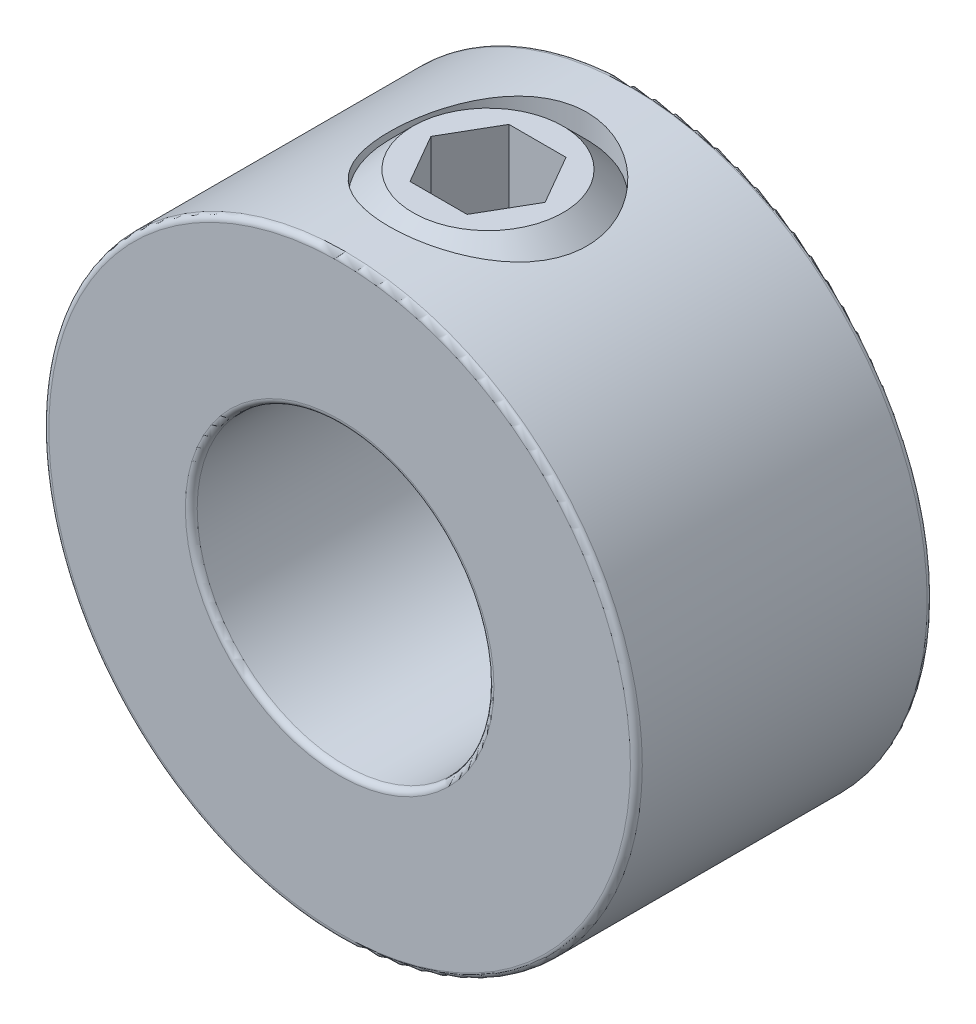
ISO-10303-21;
HEADER;
FILE_DESCRIPTION(('STEP AP214'),'2;1');
FILE_NAME('part.step','',(''),(''),'','','');
FILE_SCHEMA(('AUTOMOTIVE_DESIGN { 1 0 10303 214 1 1 1 1 }'));
ENDSEC;
DATA;
#1=APPLICATION_CONTEXT('core data for automotive mechanical design processes');
#2=APPLICATION_PROTOCOL_DEFINITION('international standard','automotive_design',2000,#1);
#3=PRODUCT_CONTEXT('',#1,'mechanical');
#4=PRODUCT('Part','Part','',(#3));
#5=PRODUCT_RELATED_PRODUCT_CATEGORY('part','',(#4));
#6=PRODUCT_DEFINITION_FORMATION('','',#4);
#7=PRODUCT_DEFINITION_CONTEXT('part definition',#1,'design');
#8=PRODUCT_DEFINITION('design','',#6,#7);
#9=PRODUCT_DEFINITION_SHAPE('','',#8);
#10=(LENGTH_UNIT() NAMED_UNIT(*) SI_UNIT(.MILLI.,.METRE.));
#11=(NAMED_UNIT(*) PLANE_ANGLE_UNIT() SI_UNIT($,.RADIAN.));
#12=(NAMED_UNIT(*) SI_UNIT($,.STERADIAN.) SOLID_ANGLE_UNIT());
#13=UNCERTAINTY_MEASURE_WITH_UNIT(LENGTH_MEASURE(1.E-05),#10,'distance_accuracy_value','');
#14=(GEOMETRIC_REPRESENTATION_CONTEXT(3) GLOBAL_UNCERTAINTY_ASSIGNED_CONTEXT((#13)) GLOBAL_UNIT_ASSIGNED_CONTEXT((#10,
#11,#12)) REPRESENTATION_CONTEXT('',''));
#15=CARTESIAN_POINT('',(0.,0.,0.));
#16=DIRECTION('',(0.,0.,1.));
#17=DIRECTION('',(1.,0.,0.));
#18=AXIS2_PLACEMENT_3D('',#15,#16,#17);
#19=CARTESIAN_POINT('',(0.,9.525,0.));
#20=DIRECTION('',(0.,1.,0.));
#21=DIRECTION('',(-1.,0.,0.));
#22=AXIS2_PLACEMENT_3D('',#19,#20,#21);
#23=PLANE('',#22);
#24=CARTESIAN_POINT('',(0.,9.525,0.));
#25=DIRECTION('',(0.,1.,0.));
#26=DIRECTION('',(-1.,0.,0.));
#27=AXIS2_PLACEMENT_3D('',#24,#25,#26);
#28=CIRCLE('',#27,2.40819263124403);
#29=CARTESIAN_POINT('',(-2.40819263124403,9.525,0.));
#30=VERTEX_POINT('',#29);
#31=EDGE_CURVE('E116',#30,#30,#28,.T.);
#32=ORIENTED_EDGE('',*,*,#31,.T.);
#33=EDGE_LOOP('',(#32));
#34=FACE_BOUND('',#33,.T.);
#35=DIRECTION('',(1.,0.,0.));
#36=VECTOR('',#35,1.);
#37=CARTESIAN_POINT('',(-0.916543552338531,9.525,-1.5875));
#38=LINE('',#37,#36);
#39=CARTESIAN_POINT('',(-0.916543552338531,9.525,-1.5875));
#40=VERTEX_POINT('',#39);
#41=CARTESIAN_POINT('',(0.916543552338531,9.525,-1.5875));
#42=VERTEX_POINT('',#41);
#43=EDGE_CURVE('E111',#40,#42,#38,.T.);
#44=ORIENTED_EDGE('',*,*,#43,.T.);
#45=DIRECTION('',(0.5,0.,0.866025403784438));
#46=VECTOR('',#45,1.);
#47=CARTESIAN_POINT('',(0.916543552338531,9.525,-1.5875));
#48=LINE('',#47,#46);
#49=CARTESIAN_POINT('',(1.83308710467706,9.525,0.));
#50=VERTEX_POINT('',#49);
#51=EDGE_CURVE('E57',#42,#50,#48,.T.);
#52=ORIENTED_EDGE('',*,*,#51,.T.);
#53=DIRECTION('',(-0.5,0.,0.866025403784439));
#54=VECTOR('',#53,1.);
#55=CARTESIAN_POINT('',(1.83308710467706,9.525,0.));
#56=LINE('',#55,#54);
#57=CARTESIAN_POINT('',(0.916543552338532,9.525,1.5875));
#58=VERTEX_POINT('',#57);
#59=EDGE_CURVE('E115',#50,#58,#56,.T.);
#60=ORIENTED_EDGE('',*,*,#59,.T.);
#61=DIRECTION('',(-1.,0.,0.));
#62=VECTOR('',#61,1.);
#63=CARTESIAN_POINT('',(0.916543552338532,9.525,1.5875));
#64=LINE('',#63,#62);
#65=CARTESIAN_POINT('',(-0.916543552338531,9.525,1.5875));
#66=VERTEX_POINT('',#65);
#67=EDGE_CURVE('E273',#58,#66,#64,.T.);
#68=ORIENTED_EDGE('',*,*,#67,.T.);
#69=DIRECTION('',(-0.5,0.,-0.866025403784439));
#70=VECTOR('',#69,1.);
#71=CARTESIAN_POINT('',(-0.916543552338531,9.525,1.5875));
#72=LINE('',#71,#70);
#73=CARTESIAN_POINT('',(-1.83308710467706,9.525,0.));
#74=VERTEX_POINT('',#73);
#75=EDGE_CURVE('E270',#66,#74,#72,.T.);
#76=ORIENTED_EDGE('',*,*,#75,.T.);
#77=DIRECTION('',(0.5,0.,-0.866025403784439));
#78=VECTOR('',#77,1.);
#79=CARTESIAN_POINT('',(-1.83308710467706,9.525,0.));
#80=LINE('',#79,#78);
#81=EDGE_CURVE('E264',#74,#40,#80,.T.);
#82=ORIENTED_EDGE('',*,*,#81,.T.);
#83=EDGE_LOOP('',(#44,#52,#60,#68,#76,#82));
#84=FACE_BOUND('',#83,.T.);
#85=ADVANCED_FACE('F42',(#34,#84),#23,.T.);
#86=CARTESIAN_POINT('',(0.,4.7625,0.));
#87=DIRECTION('',(0.,-1.,0.));
#88=DIRECTION('',(1.,0.,0.));
#89=AXIS2_PLACEMENT_3D('',#86,#87,#88);
#90=CONICAL_SURFACE('',#89,0.920168842507158,0.785398163397449);
#91=CARTESIAN_POINT('',(0.,5.68266884250716,0.));
#92=VERTEX_POINT('',#91);
#93=VERTEX_LOOP('',#92);
#94=FACE_BOUND('',#93,.T.);
#95=CARTESIAN_POINT('',(0.,4.7625,0.));
#96=DIRECTION('',(0.,1.,0.));
#97=DIRECTION('',(-1.,0.,0.));
#98=AXIS2_PLACEMENT_3D('',#95,#96,#97);
#99=CIRCLE('',#98,0.920168842507158);
#100=CARTESIAN_POINT('',(-0.920168842507158,4.7625,0.));
#101=VERTEX_POINT('',#100);
#102=EDGE_CURVE('E12',#101,#101,#99,.T.);
#103=ORIENTED_EDGE('',*,*,#102,.F.);
#104=EDGE_LOOP('',(#103));
#105=FACE_BOUND('',#104,.T.);
#106=ADVANCED_FACE('F44',(#94,#105),#90,.F.);
#107=CARTESIAN_POINT('',(-2.40819263124403,4.7625,0.));
#108=DIRECTION('',(0.,-1.,0.));
#109=DIRECTION('',(1.,0.,0.));
#110=AXIS2_PLACEMENT_3D('',#107,#108,#109);
#111=PLANE('',#110);
#112=ORIENTED_EDGE('',*,*,#102,.T.);
#113=EDGE_LOOP('',(#112));
#114=FACE_BOUND('',#113,.T.);
#115=CARTESIAN_POINT('',(0.,4.7625,0.));
#116=DIRECTION('',(0.,1.,0.));
#117=DIRECTION('',(-1.,0.,0.));
#118=AXIS2_PLACEMENT_3D('',#115,#116,#117);
#119=CIRCLE('',#118,2.40819263124403);
#120=CARTESIAN_POINT('',(-2.40819263124403,4.7625,0.));
#121=VERTEX_POINT('',#120);
#122=EDGE_CURVE('E50',#121,#121,#119,.T.);
#123=ORIENTED_EDGE('',*,*,#122,.F.);
#124=EDGE_LOOP('',(#123));
#125=FACE_BOUND('',#124,.T.);
#126=ADVANCED_FACE('F136',(#114,#125),#111,.T.);
#127=CARTESIAN_POINT('',(0.,5.52930736875596,0.));
#128=DIRECTION('',(0.,1.,0.));
#129=DIRECTION('',(-1.,0.,0.));
#130=AXIS2_PLACEMENT_3D('',#127,#128,#129);
#131=CONICAL_SURFACE('',#130,3.175,0.785398163397448);
#132=ORIENTED_EDGE('',*,*,#122,.T.);
#133=EDGE_LOOP('',(#132));
#134=FACE_BOUND('',#133,.T.);
#135=CARTESIAN_POINT('',(0.,5.52930736875596,0.));
#136=DIRECTION('',(0.,1.,0.));
#137=DIRECTION('',(-1.,0.,0.));
#138=AXIS2_PLACEMENT_3D('',#135,#136,#137);
#139=CIRCLE('',#138,3.175);
#140=CARTESIAN_POINT('',(-3.175,5.52930736875596,0.));
#141=VERTEX_POINT('',#140);
#142=EDGE_CURVE('E128',#141,#141,#139,.T.);
#143=ORIENTED_EDGE('',*,*,#142,.F.);
#144=EDGE_LOOP('',(#143));
#145=FACE_BOUND('',#144,.T.);
#146=ADVANCED_FACE('F133',(#134,#145),#131,.T.);
#147=CARTESIAN_POINT('',(0.,4.7625,0.));
#148=DIRECTION('',(0.,1.,0.));
#149=DIRECTION('',(-1.,0.,0.));
#150=AXIS2_PLACEMENT_3D('',#147,#148,#149);
#151=CYLINDRICAL_SURFACE('',#150,3.175);
#152=ORIENTED_EDGE('',*,*,#142,.T.);
#153=EDGE_LOOP('',(#152));
#154=FACE_BOUND('',#153,.T.);
#155=CARTESIAN_POINT('',(0.,8.75819263124404,0.));
#156=DIRECTION('',(0.,1.,0.));
#157=DIRECTION('',(-1.,0.,0.));
#158=AXIS2_PLACEMENT_3D('',#155,#156,#157);
#159=CIRCLE('',#158,3.175);
#160=CARTESIAN_POINT('',(-3.175,8.75819263124404,0.));
#161=VERTEX_POINT('',#160);
#162=EDGE_CURVE('E120',#161,#161,#159,.T.);
#163=ORIENTED_EDGE('',*,*,#162,.F.);
#164=EDGE_LOOP('',(#163));
#165=FACE_BOUND('',#164,.T.);
#166=ADVANCED_FACE('F143',(#154,#165),#151,.T.);
#167=CARTESIAN_POINT('',(0.,9.525,0.));
#168=DIRECTION('',(0.,-1.,0.));
#169=DIRECTION('',(1.,0.,0.));
#170=AXIS2_PLACEMENT_3D('',#167,#168,#169);
#171=CONICAL_SURFACE('',#170,2.40819263124403,0.785398163397448);
#172=ORIENTED_EDGE('',*,*,#162,.T.);
#173=EDGE_LOOP('',(#172));
#174=FACE_BOUND('',#173,.T.);
#175=ORIENTED_EDGE('',*,*,#31,.F.);
#176=EDGE_LOOP('',(#175));
#177=FACE_BOUND('',#176,.T.);
#178=ADVANCED_FACE('F154',(#174,#177),#171,.T.);
#179=CARTESIAN_POINT('',(0.916543552338531,6.35,-1.5875));
#180=DIRECTION('',(-0.866025403784438,0.,0.5));
#181=DIRECTION('',(0.5,0.,0.866025403784439));
#182=AXIS2_PLACEMENT_3D('',#179,#180,#181);
#183=PLANE('',#182);
#184=ORIENTED_EDGE('',*,*,#51,.F.);
#185=DIRECTION('',(0.,1.,0.));
#186=VECTOR('',#185,1.);
#187=CARTESIAN_POINT('',(0.916543552338531,6.35,-1.5875));
#188=LINE('',#187,#186);
#189=CARTESIAN_POINT('',(0.916543552338531,6.35,-1.5875));
#190=VERTEX_POINT('',#189);
#191=EDGE_CURVE('E110',#190,#42,#188,.T.);
#192=ORIENTED_EDGE('',*,*,#191,.F.);
#193=DIRECTION('',(0.5,0.,0.866025403784438));
#194=VECTOR('',#193,1.);
#195=CARTESIAN_POINT('',(0.916543552338531,6.35,-1.5875));
#196=LINE('',#195,#194);
#197=CARTESIAN_POINT('',(1.83308710467706,6.35,0.));
#198=VERTEX_POINT('',#197);
#199=EDGE_CURVE('E101',#190,#198,#196,.T.);
#200=ORIENTED_EDGE('',*,*,#199,.T.);
#201=DIRECTION('',(0.,1.,0.));
#202=VECTOR('',#201,1.);
#203=CARTESIAN_POINT('',(1.83308710467706,6.35,0.));
#204=LINE('',#203,#202);
#205=EDGE_CURVE('E109',#198,#50,#204,.T.);
#206=ORIENTED_EDGE('',*,*,#205,.T.);
#207=EDGE_LOOP('',(#184,#192,#200,#206));
#208=FACE_BOUND('',#207,.T.);
#209=ADVANCED_FACE('F108',(#208),#183,.T.);
#210=CARTESIAN_POINT('',(1.83308710467706,6.35,0.));
#211=DIRECTION('',(-0.866025403784439,0.,-0.5));
#212=DIRECTION('',(-0.5,0.,0.866025403784439));
#213=AXIS2_PLACEMENT_3D('',#210,#211,#212);
#214=PLANE('',#213);
#215=ORIENTED_EDGE('',*,*,#59,.F.);
#216=ORIENTED_EDGE('',*,*,#205,.F.);
#217=DIRECTION('',(-0.5,0.,0.866025403784439));
#218=VECTOR('',#217,1.);
#219=CARTESIAN_POINT('',(1.83308710467706,6.35,0.));
#220=LINE('',#219,#218);
#221=CARTESIAN_POINT('',(0.916543552338532,6.35,1.5875));
#222=VERTEX_POINT('',#221);
#223=EDGE_CURVE('E97',#198,#222,#220,.T.);
#224=ORIENTED_EDGE('',*,*,#223,.T.);
#225=DIRECTION('',(0.,1.,0.));
#226=VECTOR('',#225,1.);
#227=CARTESIAN_POINT('',(0.916543552338532,6.35,1.5875));
#228=LINE('',#227,#226);
#229=EDGE_CURVE('E117',#222,#58,#228,.T.);
#230=ORIENTED_EDGE('',*,*,#229,.T.);
#231=EDGE_LOOP('',(#215,#216,#224,#230));
#232=FACE_BOUND('',#231,.T.);
#233=ADVANCED_FACE('F113',(#232),#214,.T.);
#234=CARTESIAN_POINT('',(0.916543552338532,6.35,1.5875));
#235=DIRECTION('',(0.,0.,-1.));
#236=DIRECTION('',(-1.,0.,0.));
#237=AXIS2_PLACEMENT_3D('',#234,#235,#236);
#238=PLANE('',#237);
#239=ORIENTED_EDGE('',*,*,#67,.F.);
#240=ORIENTED_EDGE('',*,*,#229,.F.);
#241=DIRECTION('',(-1.,0.,0.));
#242=VECTOR('',#241,1.);
#243=CARTESIAN_POINT('',(0.916543552338532,6.35,1.5875));
#244=LINE('',#243,#242);
#245=CARTESIAN_POINT('',(-0.916543552338531,6.35,1.5875));
#246=VERTEX_POINT('',#245);
#247=EDGE_CURVE('E103',#222,#246,#244,.T.);
#248=ORIENTED_EDGE('',*,*,#247,.T.);
#249=DIRECTION('',(0.,1.,0.));
#250=VECTOR('',#249,1.);
#251=CARTESIAN_POINT('',(-0.916543552338531,6.35,1.5875));
#252=LINE('',#251,#250);
#253=EDGE_CURVE('E122',#246,#66,#252,.T.);
#254=ORIENTED_EDGE('',*,*,#253,.T.);
#255=EDGE_LOOP('',(#239,#240,#248,#254));
#256=FACE_BOUND('',#255,.T.);
#257=ADVANCED_FACE('F184',(#256),#238,.T.);
#258=CARTESIAN_POINT('',(-0.916543552338531,6.35,1.5875));
#259=DIRECTION('',(0.866025403784439,0.,-0.5));
#260=DIRECTION('',(-0.5,0.,-0.866025403784439));
#261=AXIS2_PLACEMENT_3D('',#258,#259,#260);
#262=PLANE('',#261);
#263=ORIENTED_EDGE('',*,*,#75,.F.);
#264=ORIENTED_EDGE('',*,*,#253,.F.);
#265=DIRECTION('',(-0.5,0.,-0.866025403784439));
#266=VECTOR('',#265,1.);
#267=CARTESIAN_POINT('',(-0.916543552338531,6.35,1.5875));
#268=LINE('',#267,#266);
#269=CARTESIAN_POINT('',(-1.83308710467706,6.35,0.));
#270=VERTEX_POINT('',#269);
#271=EDGE_CURVE('E289',#246,#270,#268,.T.);
#272=ORIENTED_EDGE('',*,*,#271,.T.);
#273=DIRECTION('',(0.,1.,0.));
#274=VECTOR('',#273,1.);
#275=CARTESIAN_POINT('',(-1.83308710467706,6.35,0.));
#276=LINE('',#275,#274);
#277=EDGE_CURVE('E280',#270,#74,#276,.T.);
#278=ORIENTED_EDGE('',*,*,#277,.T.);
#279=EDGE_LOOP('',(#263,#264,#272,#278));
#280=FACE_BOUND('',#279,.T.);
#281=ADVANCED_FACE('F190',(#280),#262,.T.);
#282=CARTESIAN_POINT('',(-1.83308710467706,6.35,0.));
#283=DIRECTION('',(0.866025403784439,0.,0.5));
#284=DIRECTION('',(0.5,0.,-0.866025403784439));
#285=AXIS2_PLACEMENT_3D('',#282,#283,#284);
#286=PLANE('',#285);
#287=ORIENTED_EDGE('',*,*,#81,.F.);
#288=ORIENTED_EDGE('',*,*,#277,.F.);
#289=DIRECTION('',(0.5,0.,-0.866025403784439));
#290=VECTOR('',#289,1.);
#291=CARTESIAN_POINT('',(-1.83308710467706,6.35,0.));
#292=LINE('',#291,#290);
#293=CARTESIAN_POINT('',(-0.916543552338531,6.35,-1.5875));
#294=VERTEX_POINT('',#293);
#295=EDGE_CURVE('E287',#270,#294,#292,.T.);
#296=ORIENTED_EDGE('',*,*,#295,.T.);
#297=DIRECTION('',(0.,1.,0.));
#298=VECTOR('',#297,1.);
#299=CARTESIAN_POINT('',(-0.916543552338531,6.35,-1.5875));
#300=LINE('',#299,#298);
#301=EDGE_CURVE('E263',#294,#40,#300,.T.);
#302=ORIENTED_EDGE('',*,*,#301,.T.);
#303=EDGE_LOOP('',(#287,#288,#296,#302));
#304=FACE_BOUND('',#303,.T.);
#305=ADVANCED_FACE('F198',(#304),#286,.T.);
#306=CARTESIAN_POINT('',(-0.916543552338531,6.35,-1.5875));
#307=DIRECTION('',(0.,0.,1.));
#308=DIRECTION('',(1.,0.,0.));
#309=AXIS2_PLACEMENT_3D('',#306,#307,#308);
#310=PLANE('',#309);
#311=ORIENTED_EDGE('',*,*,#43,.F.);
#312=ORIENTED_EDGE('',*,*,#301,.F.);
#313=DIRECTION('',(1.,0.,0.));
#314=VECTOR('',#313,1.);
#315=CARTESIAN_POINT('',(-0.916543552338531,6.35,-1.5875));
#316=LINE('',#315,#314);
#317=EDGE_CURVE('E278',#294,#190,#316,.T.);
#318=ORIENTED_EDGE('',*,*,#317,.T.);
#319=ORIENTED_EDGE('',*,*,#191,.T.);
#320=EDGE_LOOP('',(#311,#312,#318,#319));
#321=FACE_BOUND('',#320,.T.);
#322=ADVANCED_FACE('F206',(#321),#310,.T.);
#323=CARTESIAN_POINT('',(0.,6.35,-3.175));
#324=DIRECTION('',(0.,1.,0.));
#325=DIRECTION('',(0.,0.,1.));
#326=AXIS2_PLACEMENT_3D('',#323,#324,#325);
#327=PLANE('',#326);
#328=ORIENTED_EDGE('',*,*,#199,.F.);
#329=ORIENTED_EDGE('',*,*,#317,.F.);
#330=ORIENTED_EDGE('',*,*,#295,.F.);
#331=ORIENTED_EDGE('',*,*,#271,.F.);
#332=ORIENTED_EDGE('',*,*,#247,.F.);
#333=ORIENTED_EDGE('',*,*,#223,.F.);
#334=EDGE_LOOP('',(#328,#329,#330,#331,#332,#333));
#335=FACE_BOUND('',#334,.T.);
#336=ADVANCED_FACE('F99',(#335),#327,.T.);
#337=CLOSED_SHELL('',(#85,#106,#126,#146,#166,#178,#209,#233,#257,#281,#305,#322,#336));
#338=MANIFOLD_SOLID_BREP('B2',#337);
#339=CARTESIAN_POINT('',(0.,0.,4.7625));
#340=DIRECTION('',(0.,0.,1.));
#341=DIRECTION('',(1.,0.,0.));
#342=AXIS2_PLACEMENT_3D('',#339,#340,#341);
#343=PLANE('',#342);
#344=CARTESIAN_POINT('',(0.,0.,4.7625));
#345=DIRECTION('',(0.,0.,1.));
#346=DIRECTION('',(1.,0.,0.));
#347=AXIS2_PLACEMENT_3D('',#344,#345,#346);
#348=CIRCLE('',#347,4.953);
#349=CARTESIAN_POINT('',(4.953,0.,4.7625));
#350=VERTEX_POINT('',#349);
#351=EDGE_CURVE('E307',#350,#350,#348,.F.);
#352=ORIENTED_EDGE('',*,*,#351,.T.);
#353=EDGE_LOOP('',(#352));
#354=FACE_BOUND('',#353,.T.);
#355=CARTESIAN_POINT('',(0.,0.,4.7625));
#356=DIRECTION('',(0.,0.,1.));
#357=DIRECTION('',(1.,0.,0.));
#358=AXIS2_PLACEMENT_3D('',#355,#356,#357);
#359=CIRCLE('',#358,9.3345);
#360=CARTESIAN_POINT('',(9.3345,0.,4.7625));
#361=VERTEX_POINT('',#360);
#362=EDGE_CURVE('E311',#361,#361,#359,.T.);
#363=ORIENTED_EDGE('',*,*,#362,.T.);
#364=EDGE_LOOP('',(#363));
#365=FACE_BOUND('',#364,.T.);
#366=ADVANCED_FACE('F296',(#354,#365),#343,.T.);
#367=CARTESIAN_POINT('',(0.,0.,-4.7625));
#368=DIRECTION('',(0.,0.,1.));
#369=DIRECTION('',(1.,0.,0.));
#370=AXIS2_PLACEMENT_3D('',#367,#368,#369);
#371=PLANE('',#370);
#372=CARTESIAN_POINT('',(0.,0.,-4.7625));
#373=DIRECTION('',(0.,0.,1.));
#374=DIRECTION('',(1.,0.,0.));
#375=AXIS2_PLACEMENT_3D('',#372,#373,#374);
#376=CIRCLE('',#375,4.953);
#377=CARTESIAN_POINT('',(4.953,0.,-4.7625));
#378=VERTEX_POINT('',#377);
#379=EDGE_CURVE('E322',#378,#378,#376,.T.);
#380=ORIENTED_EDGE('',*,*,#379,.T.);
#381=EDGE_LOOP('',(#380));
#382=FACE_BOUND('',#381,.T.);
#383=CARTESIAN_POINT('',(0.,0.,-4.7625));
#384=DIRECTION('',(0.,0.,1.));
#385=DIRECTION('',(1.,0.,0.));
#386=AXIS2_PLACEMENT_3D('',#383,#384,#385);
#387=CIRCLE('',#386,9.3345);
#388=CARTESIAN_POINT('',(9.3345,0.,-4.7625));
#389=VERTEX_POINT('',#388);
#390=EDGE_CURVE('E325',#389,#389,#387,.F.);
#391=ORIENTED_EDGE('',*,*,#390,.T.);
#392=EDGE_LOOP('',(#391));
#393=FACE_BOUND('',#392,.T.);
#394=ADVANCED_FACE('F359',(#382,#393),#371,.F.);
#395=CARTESIAN_POINT('',(0.,0.,4.7625));
#396=DIRECTION('',(0.,0.,-1.));
#397=DIRECTION('',(-1.,0.,0.));
#398=AXIS2_PLACEMENT_3D('',#395,#396,#397);
#399=CYLINDRICAL_SURFACE('',#398,9.525);
#400=CARTESIAN_POINT('',(0.,0.,-4.572));
#401=DIRECTION('',(0.,0.,1.));
#402=DIRECTION('',(1.,0.,0.));
#403=AXIS2_PLACEMENT_3D('',#400,#401,#402);
#404=CIRCLE('',#403,9.525);
#405=CARTESIAN_POINT('',(9.525,0.,-4.572));
#406=VERTEX_POINT('',#405);
#407=EDGE_CURVE('E41',#406,#406,#404,.T.);
#408=ORIENTED_EDGE('',*,*,#407,.T.);
#409=EDGE_LOOP('',(#408));
#410=FACE_BOUND('',#409,.T.);
#411=CARTESIAN_POINT('',(0.,0.,4.572));
#412=DIRECTION('',(0.,0.,1.));
#413=DIRECTION('',(1.,0.,0.));
#414=AXIS2_PLACEMENT_3D('',#411,#412,#413);
#415=CIRCLE('',#414,9.525);
#416=CARTESIAN_POINT('',(9.525,0.,4.572));
#417=VERTEX_POINT('',#416);
#418=EDGE_CURVE('E303',#417,#417,#415,.F.);
#419=ORIENTED_EDGE('',*,*,#418,.T.);
#420=EDGE_LOOP('',(#419));
#421=FACE_BOUND('',#420,.T.);
#422=CARTESIAN_POINT('',(0.,9.525,-3.175));
#423=CARTESIAN_POINT('',(0.173238677165346,9.52500048580498,-3.17500080559796));
#424=CARTESIAN_POINT('',(0.346472492659896,9.52023018186455,-3.16077515504608));
#425=CARTESIAN_POINT('',(0.687837590771686,9.50167042395416,-3.10442257950533));
#426=CARTESIAN_POINT('',(0.855968341777246,9.48788003366834,-3.06229275796217));
#427=CARTESIAN_POINT('',(1.18215660666814,9.45277852602955,-2.95173640225564));
#428=CARTESIAN_POINT('',(1.34023044718816,9.43147998545459,-2.88335382669181));
#429=CARTESIAN_POINT('',(1.6426654243569,9.3835361515256,-2.72243177623824));
#430=CARTESIAN_POINT('',(1.78702384834389,9.35688980370195,-2.62988753611674));
#431=CARTESIAN_POINT('',(2.06292981819569,9.30002249856541,-2.41990306957346));
#432=CARTESIAN_POINT('',(2.19393674844713,9.26971591772517,-2.30177583122293));
#433=CARTESIAN_POINT('',(2.43469379932911,9.20941499436411,-2.04543928380665));
#434=CARTESIAN_POINT('',(2.54443923892904,9.17942072197493,-1.90722556410197));
#435=CARTESIAN_POINT('',(2.74264419157345,9.12219830615344,-1.60977225925124));
#436=CARTESIAN_POINT('',(2.83040092485178,9.0950744970031,-1.45004237635051));
#437=CARTESIAN_POINT('',(2.97757492456176,9.04796594704059,-1.11704090009411));
#438=CARTESIAN_POINT('',(3.03700083920298,9.02797902810367,-0.943773458008286));
#439=CARTESIAN_POINT('',(3.12379824029159,8.99830887880273,-0.594762521747942));
#440=CARTESIAN_POINT('',(3.15218269826287,8.98830104068516,-0.419299363047218));
#441=CARTESIAN_POINT('',(3.17925806658696,8.97876209798686,-0.065837580555076));
#442=CARTESIAN_POINT('',(3.17795815259498,8.97922775597168,0.112160242751682));
#443=CARTESIAN_POINT('',(3.14648819425835,8.99029872650972,0.45699880165977));
#444=CARTESIAN_POINT('',(3.11764017430521,9.00043970379417,0.623977679267887));
#445=CARTESIAN_POINT('',(3.0340495670469,9.02895888275449,0.950574107251702));
#446=CARTESIAN_POINT('',(2.97930387942919,9.04733807064542,1.11019077375635));
#447=CARTESIAN_POINT('',(2.84460650934117,9.09059367841715,1.42053547995295));
#448=CARTESIAN_POINT('',(2.76426310464556,9.11556996393148,1.57107898086575));
#449=CARTESIAN_POINT('',(2.58092291251247,9.16916373477931,1.85696513378813));
#450=CARTESIAN_POINT('',(2.47791958175572,9.19778227084722,1.99230337801349));
#451=CARTESIAN_POINT('',(2.2458341312661,9.25726270107577,2.25136582416045));
#452=CARTESIAN_POINT('',(2.11567125149229,9.28816371201626,2.3741148050663));
#453=CARTESIAN_POINT('',(1.83622813465495,9.34742029378842,2.59629677165629));
#454=CARTESIAN_POINT('',(1.68694606622308,9.37577562033364,2.69572752117228));
#455=CARTESIAN_POINT('',(1.3714336714219,9.42711817702495,2.86923575324634));
#456=CARTESIAN_POINT('',(1.20504990262187,9.45004936275525,2.94305193500683));
#457=CARTESIAN_POINT('',(0.861279339682312,9.4875530068358,3.06134507730938));
#458=CARTESIAN_POINT('',(0.683896391141978,9.50212836854242,3.10583222946942));
#459=CARTESIAN_POINT('',(0.33141865875554,9.52079715951823,3.16247673962099));
#460=CARTESIAN_POINT('',(0.156557979570887,9.52531755822087,3.17595189412349));
#461=CARTESIAN_POINT('',(-0.192960847123753,9.52464766056077,3.17394376132486));
#462=CARTESIAN_POINT('',(-0.36761902383989,9.51945900331475,3.15846536206389));
#463=CARTESIAN_POINT('',(-0.706500575516011,9.50023578476806,3.10003219293833));
#464=CARTESIAN_POINT('',(-0.870879661700627,9.48646180908036,3.05788629579286));
#465=CARTESIAN_POINT('',(-1.19016766849014,9.45171613685472,2.94832581381814));
#466=CARTESIAN_POINT('',(-1.34507537851482,9.43074352248193,2.88090800668978));
#467=CARTESIAN_POINT('',(-1.64556534104864,9.38304356837145,2.72075137890551));
#468=CARTESIAN_POINT('',(-1.79079512051444,9.35617936849621,2.62739316632593));
#469=CARTESIAN_POINT('',(-2.06395583568049,9.29974181184133,2.41873357370719));
#470=CARTESIAN_POINT('',(-2.19188146775096,9.27016762910402,2.30342549209915));
#471=CARTESIAN_POINT('',(-2.432851712285,9.20993992337912,2.04794246555408));
#472=CARTESIAN_POINT('',(-2.54495607735532,9.17929841452584,1.90687570450722));
#473=CARTESIAN_POINT('',(-2.74401763337735,9.121774152107,1.60727527220044));
#474=CARTESIAN_POINT('',(-2.83097461468097,9.09489142987857,1.44874145533681));
#475=CARTESIAN_POINT('',(-2.97687025407195,9.04819093937643,1.11863817645458));
#476=CARTESIAN_POINT('',(-3.03586556962394,9.02835890517708,0.947095898639171));
#477=CARTESIAN_POINT('',(-3.12386556696095,8.99829392572977,0.595697786109888));
#478=CARTESIAN_POINT('',(-3.15288375947876,8.98805665630055,0.415845734841193));
#479=CARTESIAN_POINT('',(-3.17905219686556,8.97883201925513,0.0628742200700937));
#480=CARTESIAN_POINT('',(-3.17776306695417,8.97929370817293,-0.110116430410661));
#481=CARTESIAN_POINT('',(-3.1471942816996,8.99005281690779,-0.453279112877545));
#482=CARTESIAN_POINT('',(-3.11791629228101,9.00034965132723,-0.623451312007403));
#483=CARTESIAN_POINT('',(-3.03330550668567,9.02920864668031,-0.952930730032847));
#484=CARTESIAN_POINT('',(-2.97847812359926,9.04761011221366,-1.11238291938927));
#485=CARTESIAN_POINT('',(-2.84473448628719,9.09054566248638,-1.419947017029));
#486=CARTESIAN_POINT('',(-2.76581288515833,9.11508110823773,-1.56805639902192));
#487=CARTESIAN_POINT('',(-2.58210269895239,9.16885482792697,-1.85573565200524));
#488=CARTESIAN_POINT('',(-2.47633567077754,9.19825159463785,-1.99465089352737));
#489=CARTESIAN_POINT('',(-2.24359115395568,9.25777156199328,-2.25326515749483));
#490=CARTESIAN_POINT('',(-2.11660766813345,9.28789496596782,-2.37295872780963));
#491=CARTESIAN_POINT('',(-1.83909194322319,9.34688346918603,-2.59443350901814));
#492=CARTESIAN_POINT('',(-1.68783480536164,9.3756537721899,-2.69533480410942));
#493=CARTESIAN_POINT('',(-1.36955960976604,9.42740021973043,-2.8701696116008));
#494=CARTESIAN_POINT('',(-1.20254559507021,9.45037784507677,-2.94411001830248));
#495=CARTESIAN_POINT('',(-0.865167329863099,9.4870751034262,-3.05981618315153));
#496=CARTESIAN_POINT('',(-0.695286130622597,9.50116249441509,-3.10287183038622));
#497=CARTESIAN_POINT('',(-0.350267320832534,9.52012342428904,-3.16045939114987));
#498=CARTESIAN_POINT('',(-0.175131176180769,9.52499950888798,-3.1749991856015));
#499=CARTESIAN_POINT('',(0.,9.525,-3.175));
#500=B_SPLINE_CURVE_WITH_KNOTS('',3,(#422,#423,#424,#425,#426,#427,#428,#429,#430,#431,#432,
#433,#434,#435,#436,#437,#438,#439,#440,#441,#442,#443,#444,#445,#446,#447,#448,#449,#450,#451,
#452,#453,#454,#455,#456,#457,#458,#459,#460,#461,#462,#463,#464,#465,#466,#467,#468,#469,#470,
#471,#472,#473,#474,#475,#476,#477,#478,#479,#480,#481,#482,#483,#484,#485,#486,#487,#488,#489,
#490,#491,#492,#493,#494,#495,#496,#497,#498,#499),.UNSPECIFIED.,.T.,.F.,(4,2,2,2,2,2,2,2,2,2,2,
2,2,2,2,2,2,2,2,2,2,2,2,2,2,2,2,2,2,2,2,2,2,2,2,2,2,2,4),(0.,0.519071561632585,1.03819701322438,
1.55645698636312,2.07481924951214,2.6093637259775,3.14402575687908,3.69406121814519,
4.24392866899746,4.77526114230342,5.30642937910266,5.81332424300314,6.32027980466155,
6.83539943417539,7.35066800622307,7.8928374595109,8.43505888444013,8.98265937939885,
9.53006948685136,10.0537512658116,10.5773446429626,11.0857715158083,11.5942632377703,
12.1161301950386,12.638156741095,13.1839024764639,13.7296527614611,14.274292439,
14.8186865394104,15.3351123975402,15.8515075194062,16.3580948898032,16.8647947620873,
17.3936046174648,17.92256420318,18.4721392315144,19.0215736265905,19.5464607283686,
20.0712027467109),.UNSPECIFIED.);
#501=CARTESIAN_POINT('',(0.,9.525,-3.175));
#502=VERTEX_POINT('',#501);
#503=EDGE_CURVE('E328',#502,#502,#500,.T.);
#504=ORIENTED_EDGE('',*,*,#503,.T.);
#505=EDGE_LOOP('',(#504));
#506=FACE_BOUND('',#505,.T.);
#507=ADVANCED_FACE('F355',(#410,#421,#506),#399,.T.);
#508=CARTESIAN_POINT('',(0.,0.,4.7625));
#509=DIRECTION('',(0.,0.,-1.));
#510=DIRECTION('',(-1.,0.,0.));
#511=AXIS2_PLACEMENT_3D('',#508,#509,#510);
#512=CYLINDRICAL_SURFACE('',#511,4.7625);
#513=CARTESIAN_POINT('',(0.,0.,-4.572));
#514=DIRECTION('',(0.,0.,1.));
#515=DIRECTION('',(1.,0.,0.));
#516=AXIS2_PLACEMENT_3D('',#513,#514,#515);
#517=CIRCLE('',#516,4.7625);
#518=CARTESIAN_POINT('',(4.7625,0.,-4.572));
#519=VERTEX_POINT('',#518);
#520=EDGE_CURVE('E316',#519,#519,#517,.F.);
#521=ORIENTED_EDGE('',*,*,#520,.T.);
#522=EDGE_LOOP('',(#521));
#523=FACE_BOUND('',#522,.T.);
#524=CARTESIAN_POINT('',(0.,0.,4.572));
#525=DIRECTION('',(0.,0.,1.));
#526=DIRECTION('',(1.,0.,0.));
#527=AXIS2_PLACEMENT_3D('',#524,#525,#526);
#528=CIRCLE('',#527,4.7625);
#529=CARTESIAN_POINT('',(4.7625,0.,4.572));
#530=VERTEX_POINT('',#529);
#531=EDGE_CURVE('E319',#530,#530,#528,.T.);
#532=ORIENTED_EDGE('',*,*,#531,.T.);
#533=EDGE_LOOP('',(#532));
#534=FACE_BOUND('',#533,.T.);
#535=CARTESIAN_POINT('',(0.,4.7625,-3.175));
#536=CARTESIAN_POINT('',(0.159513506146526,4.76249829558772,-3.17499785387674));
#537=CARTESIAN_POINT('',(0.319036822940597,4.75441585981929,-3.16291201378244));
#538=CARTESIAN_POINT('',(0.632990333269339,4.72288699141972,-3.1153157875296));
#539=CARTESIAN_POINT('',(0.787418072256468,4.6994332647002,-3.07979428046729));
#540=CARTESIAN_POINT('',(1.0861866118583,4.63947623936465,-2.98750378332687));
#541=CARTESIAN_POINT('',(1.23057094564588,4.60303407934685,-2.93083428235374));
#542=CARTESIAN_POINT('',(1.50719688917279,4.52002748417047,-2.79866196869855));
#543=CARTESIAN_POINT('',(1.63943673208792,4.47346157948094,-2.72315642160038));
#544=CARTESIAN_POINT('',(1.90068942785739,4.36923384005694,-2.54848209446027));
#545=CARTESIAN_POINT('',(2.0284762255929,4.31096574538352,-2.44784901636421));
#546=CARTESIAN_POINT('',(2.26651828028912,4.19071922389352,-2.22927855246795));
#547=CARTESIAN_POINT('',(2.37674794067855,4.12873555797057,-2.11131637522972));
#548=CARTESIAN_POINT('',(2.59432897361932,3.99618620055343,-1.83982936485523));
#549=CARTESIAN_POINT('',(2.69848308269039,3.92580920318787,-1.68363002512644));
#550=CARTESIAN_POINT('',(2.87893691841686,3.79546083955007,-1.35197313839848));
#551=CARTESIAN_POINT('',(2.95528481583058,3.73547157335729,-1.17654958761288));
#552=CARTESIAN_POINT('',(3.0587003056751,3.65087323287846,-0.862470821626492));
#553=CARTESIAN_POINT('',(3.09363184983488,3.62104984276855,-0.727823581043082));
#554=CARTESIAN_POINT('',(3.14564105737718,3.57597026836952,-0.452843098742185));
#555=CARTESIAN_POINT('',(3.16274949511548,3.56068897885195,-0.312520093909076));
#556=CARTESIAN_POINT('',(3.17803790572636,3.54705611398895,-0.0294087885536061));
#557=CARTESIAN_POINT('',(3.17614050629003,3.54877374048434,0.113387224758058));
#558=CARTESIAN_POINT('',(3.1533716036927,3.56901393593137,0.396295520403469));
#559=CARTESIAN_POINT('',(3.13248402562585,3.58755074204361,0.536405426371809));
#560=CARTESIAN_POINT('',(3.07443178311274,3.63739407712628,0.804016443958601));
#561=CARTESIAN_POINT('',(3.03802591942409,3.66810112544892,0.931801121179955));
#562=CARTESIAN_POINT('',(2.95068813219861,3.73871526235139,1.17955010979676));
#563=CARTESIAN_POINT('',(2.89975142875274,3.77862537744388,1.29951183185715));
#564=CARTESIAN_POINT('',(2.77294687249444,3.87293161809884,1.55420281498847));
#565=CARTESIAN_POINT('',(2.69411533030023,3.92862304429405,1.68697259197917));
#566=CARTESIAN_POINT('',(2.51886974692605,4.04322816135652,1.93894614005392));
#567=CARTESIAN_POINT('',(2.42243402035992,4.10214576296336,2.05813288170832));
#568=CARTESIAN_POINT('',(2.19045099950254,4.23137558230652,2.30591129113202));
#569=CARTESIAN_POINT('',(2.05095377025594,4.30140657245416,2.43099280228032));
#570=CARTESIAN_POINT('',(1.74943769853673,4.43258734804498,2.65619943508341));
#571=CARTESIAN_POINT('',(1.58744015020742,4.493745420159,2.75634790583761));
#572=CARTESIAN_POINT('',(1.2777118005163,4.59018328993748,2.91064587831312));
#573=CARTESIAN_POINT('',(1.13340775885306,4.62818577100373,2.96996383930038));
#574=CARTESIAN_POINT('',(0.835082219747426,4.69118503960837,3.06721656943046));
#575=CARTESIAN_POINT('',(0.681069057915083,4.71619281752454,3.10516941057244));
#576=CARTESIAN_POINT('',(0.366689406911032,4.75100462923954,3.15779334981527));
#577=CARTESIAN_POINT('',(0.206298501445472,4.76074299407139,3.17236389423949));
#578=CARTESIAN_POINT('',(-0.115000912030585,4.76381945007165,3.17697975309251));
#579=CARTESIAN_POINT('',(-0.27590938307122,4.75715868774695,3.16702678202589));
#580=CARTESIAN_POINT('',(-0.581748451061773,4.72915598211033,3.12479681179543));
#581=CARTESIAN_POINT('',(-0.727007443428387,4.70887816144478,3.09413703981371));
#582=CARTESIAN_POINT('',(-1.00983477297833,4.65643038239684,3.01371684845446));
#583=CARTESIAN_POINT('',(-1.14740187964354,4.62425852748368,2.963953382901));
#584=CARTESIAN_POINT('',(-1.42028029136544,4.54812959640013,2.84376447844169));
#585=CARTESIAN_POINT('',(-1.55495019310495,4.50357668840463,2.77227005539697));
#586=CARTESIAN_POINT('',(-1.81083430052963,4.40692945783369,2.61233715220837));
#587=CARTESIAN_POINT('',(-1.93204012275933,4.35483048266614,2.52388820764801));
#588=CARTESIAN_POINT('',(-2.17781894704302,4.23790342811906,2.31678500930826));
#589=CARTESIAN_POINT('',(-2.29989360271145,4.17236523918599,2.19556606216409));
#590=CARTESIAN_POINT('',(-2.52307674305786,4.04131737275621,1.93498560490976));
#591=CARTESIAN_POINT('',(-2.62417073664107,3.97580774594569,1.79561166279185));
#592=CARTESIAN_POINT('',(-2.79598082787364,3.85666740360083,1.51266141984501));
#593=CARTESIAN_POINT('',(-2.86854322403869,3.80250060257811,1.37043789728911));
#594=CARTESIAN_POINT('',(-2.99237739257787,3.70584371667973,1.07335216383611));
#595=CARTESIAN_POINT('',(-3.04368748566418,3.66333266217137,0.918513308918401));
#596=CARTESIAN_POINT('',(-3.11524401668582,3.60256467927562,0.627753877826356));
#597=CARTESIAN_POINT('',(-3.13941774208684,3.58132059145467,0.493439756093283));
#598=CARTESIAN_POINT('',(-3.17022488831674,3.55408653184003,0.221339911640261));
#599=CARTESIAN_POINT('',(-3.17687736084456,3.54807999179148,0.0835581242544777));
#600=CARTESIAN_POINT('',(-3.17220478264998,3.55225668535638,-0.191520836727938));
#601=CARTESIAN_POINT('',(-3.16086908702961,3.56244950530632,-0.328817675150234));
#602=CARTESIAN_POINT('',(-3.12097725174618,3.59744096141944,-0.599032910654162));
#603=CARTESIAN_POINT('',(-3.09239813794198,3.6222590824651,-0.731945216428473));
#604=CARTESIAN_POINT('',(-3.00978981561158,3.69136350740653,-1.02506622898968));
#605=CARTESIAN_POINT('',(-2.9510082914772,3.7390752101256,-1.18311132192876));
#606=CARTESIAN_POINT('',(-2.81121528101009,3.84527739400297,-1.48508652360585));
#607=CARTESIAN_POINT('',(-2.7301725841297,3.90378297026142,-1.6289964271167));
#608=CARTESIAN_POINT('',(-2.54632873237353,4.02617059026332,-1.90385549633636));
#609=CARTESIAN_POINT('',(-2.44315837250285,4.09013111420677,-2.03452106373605));
#610=CARTESIAN_POINT('',(-2.21726660759133,4.21685775015533,-2.27859138405742));
#611=CARTESIAN_POINT('',(-2.09453921249741,4.27962348959933,-2.39199082772431));
#612=CARTESIAN_POINT('',(-1.8873850660108,4.37333498138708,-2.55491858498312));
#613=CARTESIAN_POINT('',(-1.8090134436431,4.40641312548886,-2.61102761986732));
#614=CARTESIAN_POINT('',(-1.64665981934884,4.46961905722944,-2.71633779885705));
#615=CARTESIAN_POINT('',(-1.56268042207704,4.49974819878214,-2.76554211752335));
#616=CARTESIAN_POINT('',(-1.38960715113393,4.55616827072524,-2.85642356224378));
#617=CARTESIAN_POINT('',(-1.30051812806183,4.58246276002165,-2.89810767636216));
#618=CARTESIAN_POINT('',(-1.11782960098096,4.63042056995049,-2.97335672820606));
#619=CARTESIAN_POINT('',(-1.02423169482462,4.65208551661339,-3.00692451716838));
#620=CARTESIAN_POINT('',(-0.780235392827374,4.70058109652366,-3.08154139984118));
#621=CARTESIAN_POINT('',(-0.627104096318095,4.72362103868264,-3.11642765689178));
#622=CARTESIAN_POINT('',(-0.315982580686494,4.75457565287333,-3.16314936096945));
#623=CARTESIAN_POINT('',(-0.157996102785209,4.76250168819873,-3.17500212570784));
#624=CARTESIAN_POINT('',(0.,4.7625,-3.175));
#625=B_SPLINE_CURVE_WITH_KNOTS('',3,(#535,#536,#537,#538,#539,#540,#541,#542,#543,#544,#545,
#546,#547,#548,#549,#550,#551,#552,#553,#554,#555,#556,#557,#558,#559,#560,#561,#562,#563,#564,
#565,#566,#567,#568,#569,#570,#571,#572,#573,#574,#575,#576,#577,#578,#579,#580,#581,#582,#583,
#584,#585,#586,#587,#588,#589,#590,#591,#592,#593,#594,#595,#596,#597,#598,#599,#600,#601,#602,
#603,#604,#605,#606,#607,#608,#609,#610,#611,#612,#613,#614,#615,#616,#617,#618,#619,#620,#621,
#622,#623,#624),.UNSPECIFIED.,.T.,.F.,(4,2,2,2,2,2,2,2,2,2,2,2,2,2,2,2,2,2,2,2,2,2,2,2,2,2,2,2,
2,2,2,2,2,2,2,2,2,2,2,2,2,2,2,2,4),(0.,0.477921997077321,0.956070945278542,1.43199826818949,
1.90799472139476,2.42438283538384,2.94151703421856,3.54023109732372,4.13790297394634,
4.56300988710696,4.98738156455221,5.41348154879912,5.83994255655571,6.24758818745148,
6.6553680680092,7.14609274784494,7.63742604761198,8.23466340273952,8.8313393398877,
9.31106989228961,9.79039404549573,10.2717740223998,10.7531203456965,11.2006552211841,
11.6482614879236,12.1229810060221,12.5979944723587,13.1481222963466,13.6986288317687,
14.2025677230621,14.705593948025,15.1181442623597,15.5302458053914,15.9425913096208,
16.3554874162604,16.8784049132826,17.4020593249786,17.9352455177248,18.4685953331297,
18.7739424593009,19.0791487337135,19.3840699212457,19.6888838348845,20.1626158186784,
20.635991489477),.UNSPECIFIED.);
#626=CARTESIAN_POINT('',(0.,4.7625,-3.175));
#627=VERTEX_POINT('',#626);
#628=EDGE_CURVE('E329',#627,#627,#625,.T.);
#629=ORIENTED_EDGE('',*,*,#628,.F.);
#630=EDGE_LOOP('',(#629));
#631=FACE_BOUND('',#630,.T.);
#632=ADVANCED_FACE('F339',(#523,#534,#631),#512,.F.);
#633=CARTESIAN_POINT('',(0.,9.525,0.));
#634=DIRECTION('',(0.,-1.,0.));
#635=DIRECTION('',(0.,0.,-1.));
#636=AXIS2_PLACEMENT_3D('',#633,#634,#635);
#637=CYLINDRICAL_SURFACE('',#636,3.175);
#638=ORIENTED_EDGE('',*,*,#628,.T.);
#639=EDGE_LOOP('',(#638));
#640=FACE_BOUND('',#639,.T.);
#641=ORIENTED_EDGE('',*,*,#503,.F.);
#642=EDGE_LOOP('',(#641));
#643=FACE_BOUND('',#642,.T.);
#644=ADVANCED_FACE('F342',(#640,#643),#637,.F.);
#645=CARTESIAN_POINT('',(0.,0.,-4.572));
#646=DIRECTION('',(0.,0.,1.));
#647=DIRECTION('',(1.,0.,0.));
#648=AXIS2_PLACEMENT_3D('',#645,#646,#647);
#649=TOROIDAL_SURFACE('',#648,4.953,0.1905);
#650=ORIENTED_EDGE('',*,*,#520,.F.);
#651=EDGE_LOOP('',(#650));
#652=FACE_BOUND('',#651,.T.);
#653=ORIENTED_EDGE('',*,*,#379,.F.);
#654=EDGE_LOOP('',(#653));
#655=FACE_BOUND('',#654,.T.);
#656=ADVANCED_FACE('F345',(#652,#655),#649,.T.);
#657=CARTESIAN_POINT('',(0.,0.,4.572));
#658=DIRECTION('',(0.,0.,1.));
#659=DIRECTION('',(1.,0.,0.));
#660=AXIS2_PLACEMENT_3D('',#657,#658,#659);
#661=TOROIDAL_SURFACE('',#660,4.953,0.1905);
#662=ORIENTED_EDGE('',*,*,#351,.F.);
#663=EDGE_LOOP('',(#662));
#664=FACE_BOUND('',#663,.T.);
#665=ORIENTED_EDGE('',*,*,#531,.F.);
#666=EDGE_LOOP('',(#665));
#667=FACE_BOUND('',#666,.T.);
#668=ADVANCED_FACE('F352',(#664,#667),#661,.T.);
#669=CARTESIAN_POINT('',(0.,0.,-4.572));
#670=DIRECTION('',(0.,0.,1.));
#671=DIRECTION('',(1.,0.,0.));
#672=AXIS2_PLACEMENT_3D('',#669,#670,#671);
#673=TOROIDAL_SURFACE('',#672,9.3345,0.1905);
#674=ORIENTED_EDGE('',*,*,#390,.F.);
#675=EDGE_LOOP('',(#674));
#676=FACE_BOUND('',#675,.T.);
#677=ORIENTED_EDGE('',*,*,#407,.F.);
#678=EDGE_LOOP('',(#677));
#679=FACE_BOUND('',#678,.T.);
#680=ADVANCED_FACE('F371',(#676,#679),#673,.T.);
#681=CARTESIAN_POINT('',(0.,0.,4.572));
#682=DIRECTION('',(0.,0.,1.));
#683=DIRECTION('',(1.,0.,0.));
#684=AXIS2_PLACEMENT_3D('',#681,#682,#683);
#685=TOROIDAL_SURFACE('',#684,9.3345,0.1905);
#686=ORIENTED_EDGE('',*,*,#418,.F.);
#687=EDGE_LOOP('',(#686));
#688=FACE_BOUND('',#687,.T.);
#689=ORIENTED_EDGE('',*,*,#362,.F.);
#690=EDGE_LOOP('',(#689));
#691=FACE_BOUND('',#690,.T.);
#692=ADVANCED_FACE('F298',(#688,#691),#685,.T.);
#693=CLOSED_SHELL('',(#366,#394,#507,#632,#644,#656,#668,#680,#692));
#694=MANIFOLD_SOLID_BREP('B6',#693);
#695=ADVANCED_BREP_SHAPE_REPRESENTATION('',(#18,#338,#694),#14);
#696=SHAPE_DEFINITION_REPRESENTATION(#9,#695);
ENDSEC;
END-ISO-10303-21;
